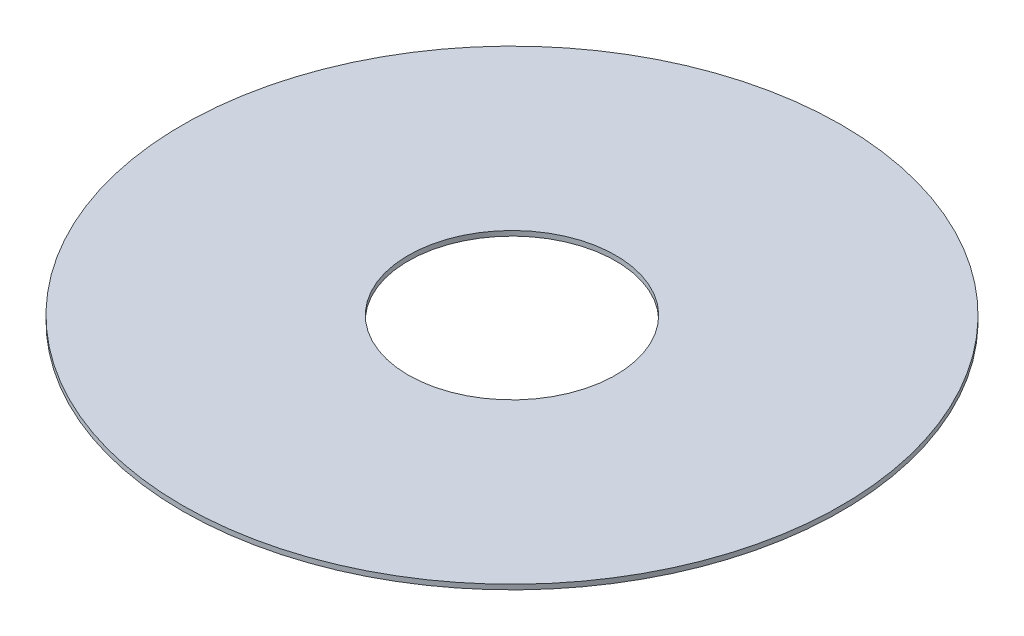
ISO-10303-21;
HEADER;
FILE_DESCRIPTION(('STEP AP214'),'2;1');
FILE_NAME('part.step','',(''),(''),'','','');
FILE_SCHEMA(('AUTOMOTIVE_DESIGN { 1 0 10303 214 1 1 1 1 }'));
ENDSEC;
DATA;
#1=APPLICATION_CONTEXT('core data for automotive mechanical design processes');
#2=APPLICATION_PROTOCOL_DEFINITION('international standard','automotive_design',2000,#1);
#3=PRODUCT_CONTEXT('',#1,'mechanical');
#4=PRODUCT('Part','Part','',(#3));
#5=PRODUCT_RELATED_PRODUCT_CATEGORY('part','',(#4));
#6=PRODUCT_DEFINITION_FORMATION('','',#4);
#7=PRODUCT_DEFINITION_CONTEXT('part definition',#1,'design');
#8=PRODUCT_DEFINITION('design','',#6,#7);
#9=PRODUCT_DEFINITION_SHAPE('','',#8);
#10=(LENGTH_UNIT() NAMED_UNIT(*) SI_UNIT(.MILLI.,.METRE.));
#11=(NAMED_UNIT(*) PLANE_ANGLE_UNIT() SI_UNIT($,.RADIAN.));
#12=(NAMED_UNIT(*) SI_UNIT($,.STERADIAN.) SOLID_ANGLE_UNIT());
#13=UNCERTAINTY_MEASURE_WITH_UNIT(LENGTH_MEASURE(1.E-05),#10,'distance_accuracy_value','');
#14=(GEOMETRIC_REPRESENTATION_CONTEXT(3) GLOBAL_UNCERTAINTY_ASSIGNED_CONTEXT((#13)) GLOBAL_UNIT_ASSIGNED_CONTEXT((#10,
#11,#12)) REPRESENTATION_CONTEXT('',''));
#15=CARTESIAN_POINT('',(0.,0.,0.));
#16=DIRECTION('',(0.,0.,1.));
#17=DIRECTION('',(1.,0.,0.));
#18=AXIS2_PLACEMENT_3D('',#15,#16,#17);
#19=CARTESIAN_POINT('',(0.,0.508,0.));
#20=DIRECTION('',(0.,1.,0.));
#21=DIRECTION('',(0.,0.,1.));
#22=AXIS2_PLACEMENT_3D('',#19,#20,#21);
#23=PLANE('',#22);
#24=CARTESIAN_POINT('',(0.,0.508,0.));
#25=DIRECTION('',(0.,1.,0.));
#26=DIRECTION('',(0.,0.,1.));
#27=AXIS2_PLACEMENT_3D('',#24,#25,#26);
#28=CIRCLE('',#27,34.29);
#29=CARTESIAN_POINT('',(0.,0.508,34.29));
#30=VERTEX_POINT('',#29);
#31=EDGE_CURVE('E10',#30,#30,#28,.T.);
#32=ORIENTED_EDGE('',*,*,#31,.T.);
#33=EDGE_LOOP('',(#32));
#34=FACE_BOUND('',#33,.T.);
#35=CARTESIAN_POINT('',(0.,0.508,0.));
#36=DIRECTION('',(0.,1.,0.));
#37=DIRECTION('',(0.,0.,1.));
#38=AXIS2_PLACEMENT_3D('',#35,#36,#37);
#39=CIRCLE('',#38,10.795);
#40=CARTESIAN_POINT('',(0.,0.508,10.795));
#41=VERTEX_POINT('',#40);
#42=EDGE_CURVE('E42',#41,#41,#39,.T.);
#43=ORIENTED_EDGE('',*,*,#42,.F.);
#44=EDGE_LOOP('',(#43));
#45=FACE_BOUND('',#44,.T.);
#46=ADVANCED_FACE('F31',(#34,#45),#23,.T.);
#47=CARTESIAN_POINT('',(0.,0.,0.));
#48=DIRECTION('',(0.,1.,0.));
#49=DIRECTION('',(0.,0.,1.));
#50=AXIS2_PLACEMENT_3D('',#47,#48,#49);
#51=PLANE('',#50);
#52=CARTESIAN_POINT('',(0.,0.,0.));
#53=DIRECTION('',(0.,1.,0.));
#54=DIRECTION('',(0.,0.,1.));
#55=AXIS2_PLACEMENT_3D('',#52,#53,#54);
#56=CIRCLE('',#55,34.29);
#57=CARTESIAN_POINT('',(0.,0.,34.29));
#58=VERTEX_POINT('',#57);
#59=EDGE_CURVE('E35',#58,#58,#56,.T.);
#60=ORIENTED_EDGE('',*,*,#59,.F.);
#61=EDGE_LOOP('',(#60));
#62=FACE_BOUND('',#61,.T.);
#63=CARTESIAN_POINT('',(0.,0.,0.));
#64=DIRECTION('',(0.,1.,0.));
#65=DIRECTION('',(0.,0.,1.));
#66=AXIS2_PLACEMENT_3D('',#63,#64,#65);
#67=CIRCLE('',#66,10.795);
#68=CARTESIAN_POINT('',(0.,0.,10.795));
#69=VERTEX_POINT('',#68);
#70=EDGE_CURVE('E44',#69,#69,#67,.T.);
#71=ORIENTED_EDGE('',*,*,#70,.T.);
#72=EDGE_LOOP('',(#71));
#73=FACE_BOUND('',#72,.T.);
#74=ADVANCED_FACE('F54',(#62,#73),#51,.F.);
#75=CARTESIAN_POINT('',(0.,0.508,0.));
#76=DIRECTION('',(0.,-1.,0.));
#77=DIRECTION('',(0.,0.,-1.));
#78=AXIS2_PLACEMENT_3D('',#75,#76,#77);
#79=CYLINDRICAL_SURFACE('',#78,34.29);
#80=ORIENTED_EDGE('',*,*,#31,.F.);
#81=EDGE_LOOP('',(#80));
#82=FACE_BOUND('',#81,.T.);
#83=ORIENTED_EDGE('',*,*,#59,.T.);
#84=EDGE_LOOP('',(#83));
#85=FACE_BOUND('',#84,.T.);
#86=ADVANCED_FACE('F33',(#82,#85),#79,.T.);
#87=CARTESIAN_POINT('',(0.,0.508,0.));
#88=DIRECTION('',(0.,-1.,0.));
#89=DIRECTION('',(0.,0.,-1.));
#90=AXIS2_PLACEMENT_3D('',#87,#88,#89);
#91=CYLINDRICAL_SURFACE('',#90,10.795);
#92=ORIENTED_EDGE('',*,*,#42,.T.);
#93=EDGE_LOOP('',(#92));
#94=FACE_BOUND('',#93,.T.);
#95=ORIENTED_EDGE('',*,*,#70,.F.);
#96=EDGE_LOOP('',(#95));
#97=FACE_BOUND('',#96,.T.);
#98=ADVANCED_FACE('F50',(#94,#97),#91,.F.);
#99=CLOSED_SHELL('',(#46,#74,#86,#98));
#100=MANIFOLD_SOLID_BREP('B2',#99);
#101=ADVANCED_BREP_SHAPE_REPRESENTATION('',(#18,#100),#14);
#102=SHAPE_DEFINITION_REPRESENTATION(#9,#101);
ENDSEC;
END-ISO-10303-21;
